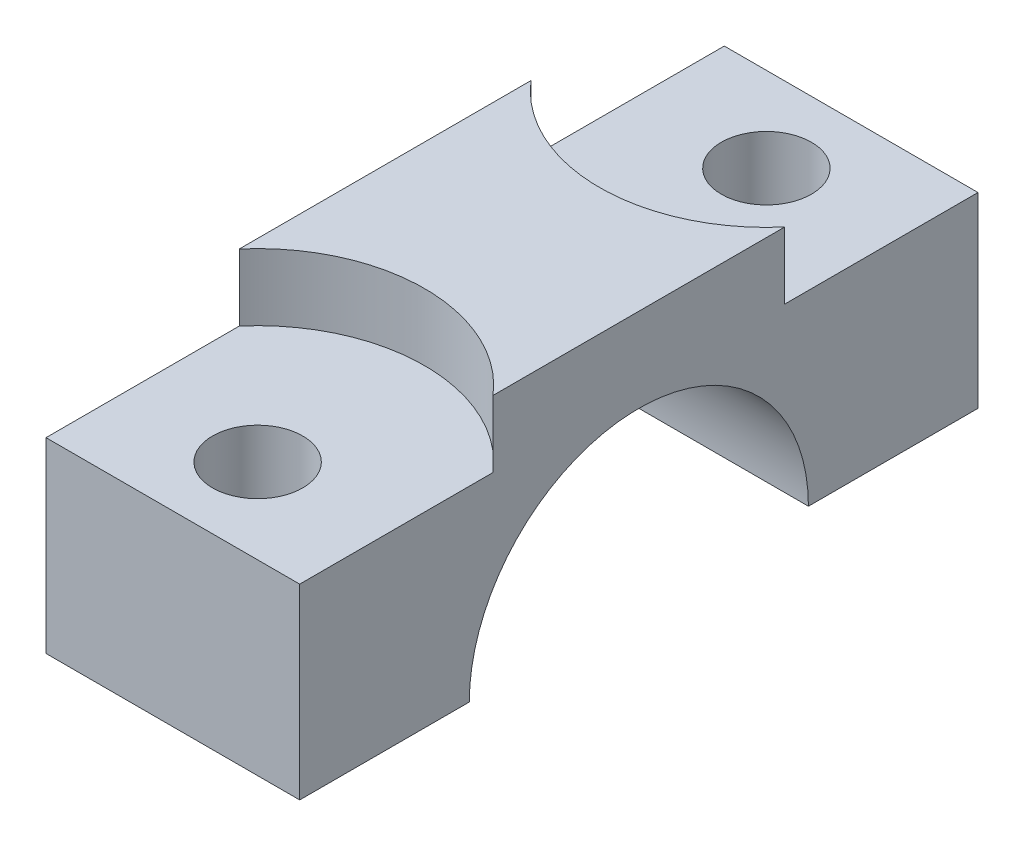
ISO-10303-21;
HEADER;
FILE_DESCRIPTION(('STEP AP214'),'2;1');
FILE_NAME('part.step','',(''),(''),'','','');
FILE_SCHEMA(('AUTOMOTIVE_DESIGN { 1 0 10303 214 1 1 1 1 }'));
ENDSEC;
DATA;
#1=APPLICATION_CONTEXT('core data for automotive mechanical design processes');
#2=APPLICATION_PROTOCOL_DEFINITION('international standard','automotive_design',2000,#1);
#3=PRODUCT_CONTEXT('',#1,'mechanical');
#4=PRODUCT('Part','Part','',(#3));
#5=PRODUCT_RELATED_PRODUCT_CATEGORY('part','',(#4));
#6=PRODUCT_DEFINITION_FORMATION('','',#4);
#7=PRODUCT_DEFINITION_CONTEXT('part definition',#1,'design');
#8=PRODUCT_DEFINITION('design','',#6,#7);
#9=PRODUCT_DEFINITION_SHAPE('','',#8);
#10=(LENGTH_UNIT() NAMED_UNIT(*) SI_UNIT(.MILLI.,.METRE.));
#11=(NAMED_UNIT(*) PLANE_ANGLE_UNIT() SI_UNIT($,.RADIAN.));
#12=(NAMED_UNIT(*) SI_UNIT($,.STERADIAN.) SOLID_ANGLE_UNIT());
#13=UNCERTAINTY_MEASURE_WITH_UNIT(LENGTH_MEASURE(1.E-05),#10,'distance_accuracy_value','');
#14=(GEOMETRIC_REPRESENTATION_CONTEXT(3) GLOBAL_UNCERTAINTY_ASSIGNED_CONTEXT((#13)) GLOBAL_UNIT_ASSIGNED_CONTEXT((#10,
#11,#12)) REPRESENTATION_CONTEXT('',''));
#15=CARTESIAN_POINT('',(0.,0.,0.));
#16=DIRECTION('',(0.,0.,1.));
#17=DIRECTION('',(1.,0.,0.));
#18=AXIS2_PLACEMENT_3D('',#15,#16,#17);
#19=CARTESIAN_POINT('',(9.5,19.,25.4));
#20=DIRECTION('',(0.,1.,0.));
#21=DIRECTION('',(0.,0.,1.));
#22=AXIS2_PLACEMENT_3D('',#19,#20,#21);
#23=PLANE('',#22);
#24=CARTESIAN_POINT('',(0.,19.,19.05));
#25=DIRECTION('',(0.,1.,0.));
#26=DIRECTION('',(0.,0.,1.));
#27=AXIS2_PLACEMENT_3D('',#24,#25,#26);
#28=CIRCLE('',#27,12.5);
#29=CARTESIAN_POINT('',(9.5,19.,10.925961595364));
#30=VERTEX_POINT('',#29);
#31=CARTESIAN_POINT('',(-9.5,19.,10.925961595364));
#32=VERTEX_POINT('',#31);
#33=EDGE_CURVE('E130',#30,#32,#28,.T.);
#34=ORIENTED_EDGE('',*,*,#33,.F.);
#35=DIRECTION('',(0.,0.,-1.));
#36=VECTOR('',#35,1.);
#37=CARTESIAN_POINT('',(9.5,19.,25.4));
#38=LINE('',#37,#36);
#39=CARTESIAN_POINT('',(9.5,19.,-10.925961595364));
#40=VERTEX_POINT('',#39);
#41=EDGE_CURVE('E62',#30,#40,#38,.T.);
#42=ORIENTED_EDGE('',*,*,#41,.T.);
#43=CARTESIAN_POINT('',(0.,19.,-19.05));
#44=DIRECTION('',(0.,1.,0.));
#45=DIRECTION('',(0.,0.,1.));
#46=AXIS2_PLACEMENT_3D('',#43,#44,#45);
#47=CIRCLE('',#46,12.5);
#48=CARTESIAN_POINT('',(-9.5,19.,-10.925961595364));
#49=VERTEX_POINT('',#48);
#50=EDGE_CURVE('E134',#49,#40,#47,.T.);
#51=ORIENTED_EDGE('',*,*,#50,.F.);
#52=DIRECTION('',(0.,0.,-1.));
#53=VECTOR('',#52,1.);
#54=CARTESIAN_POINT('',(-9.5,19.,25.4));
#55=LINE('',#54,#53);
#56=EDGE_CURVE('E153',#32,#49,#55,.T.);
#57=ORIENTED_EDGE('',*,*,#56,.F.);
#58=EDGE_LOOP('',(#34,#42,#51,#57));
#59=FACE_BOUND('',#58,.T.);
#60=ADVANCED_FACE('F41',(#59),#23,.T.);
#61=CARTESIAN_POINT('',(9.5,19.,25.4));
#62=DIRECTION('',(0.,0.,-1.));
#63=DIRECTION('',(0.,1.,0.));
#64=AXIS2_PLACEMENT_3D('',#61,#62,#63);
#65=PLANE('',#64);
#66=DIRECTION('',(0.,-1.,0.));
#67=VECTOR('',#66,1.);
#68=CARTESIAN_POINT('',(9.5,19.,25.4));
#69=LINE('',#68,#67);
#70=CARTESIAN_POINT('',(9.5,14.,25.4));
#71=VERTEX_POINT('',#70);
#72=CARTESIAN_POINT('',(9.5,0.,25.4));
#73=VERTEX_POINT('',#72);
#74=EDGE_CURVE('E165',#71,#73,#69,.T.);
#75=ORIENTED_EDGE('',*,*,#74,.F.);
#76=DIRECTION('',(-1.,0.,0.));
#77=VECTOR('',#76,1.);
#78=CARTESIAN_POINT('',(9.5,14.,25.4));
#79=LINE('',#78,#77);
#80=CARTESIAN_POINT('',(-9.5,14.,25.4));
#81=VERTEX_POINT('',#80);
#82=EDGE_CURVE('E119',#71,#81,#79,.T.);
#83=ORIENTED_EDGE('',*,*,#82,.T.);
#84=DIRECTION('',(0.,-1.,0.));
#85=VECTOR('',#84,1.);
#86=CARTESIAN_POINT('',(-9.5,19.,25.4));
#87=LINE('',#86,#85);
#88=CARTESIAN_POINT('',(-9.5,0.,25.4));
#89=VERTEX_POINT('',#88);
#90=EDGE_CURVE('E156',#81,#89,#87,.T.);
#91=ORIENTED_EDGE('',*,*,#90,.T.);
#92=DIRECTION('',(-1.,0.,0.));
#93=VECTOR('',#92,1.);
#94=CARTESIAN_POINT('',(9.5,0.,25.4));
#95=LINE('',#94,#93);
#96=EDGE_CURVE('E179',#73,#89,#95,.T.);
#97=ORIENTED_EDGE('',*,*,#96,.F.);
#98=EDGE_LOOP('',(#75,#83,#91,#97));
#99=FACE_BOUND('',#98,.T.);
#100=ADVANCED_FACE('F199',(#99),#65,.F.);
#101=CARTESIAN_POINT('',(9.5,0.,25.4));
#102=DIRECTION('',(0.,1.,0.));
#103=DIRECTION('',(0.,0.,1.));
#104=AXIS2_PLACEMENT_3D('',#101,#102,#103);
#105=PLANE('',#104);
#106=CARTESIAN_POINT('',(0.,0.,19.05));
#107=DIRECTION('',(0.,1.,0.));
#108=DIRECTION('',(0.,0.,1.));
#109=AXIS2_PLACEMENT_3D('',#106,#107,#108);
#110=CIRCLE('',#109,3.375);
#111=CARTESIAN_POINT('',(0.,0.,22.425));
#112=VERTEX_POINT('',#111);
#113=EDGE_CURVE('E201',#112,#112,#110,.T.);
#114=ORIENTED_EDGE('',*,*,#113,.T.);
#115=EDGE_LOOP('',(#114));
#116=FACE_BOUND('',#115,.T.);
#117=DIRECTION('',(0.,0.,-1.));
#118=VECTOR('',#117,1.);
#119=CARTESIAN_POINT('',(-9.5,0.,25.4));
#120=LINE('',#119,#118);
#121=CARTESIAN_POINT('',(-9.5,0.,12.7));
#122=VERTEX_POINT('',#121);
#123=EDGE_CURVE('E176',#89,#122,#120,.T.);
#124=ORIENTED_EDGE('',*,*,#123,.T.);
#125=DIRECTION('',(-1.,0.,0.));
#126=VECTOR('',#125,1.);
#127=CARTESIAN_POINT('',(9.5,0.,12.7));
#128=LINE('',#127,#126);
#129=CARTESIAN_POINT('',(9.5,0.,12.7));
#130=VERTEX_POINT('',#129);
#131=EDGE_CURVE('E183',#130,#122,#128,.T.);
#132=ORIENTED_EDGE('',*,*,#131,.F.);
#133=DIRECTION('',(0.,0.,-1.));
#134=VECTOR('',#133,1.);
#135=CARTESIAN_POINT('',(9.5,0.,25.4));
#136=LINE('',#135,#134);
#137=EDGE_CURVE('E163',#73,#130,#136,.T.);
#138=ORIENTED_EDGE('',*,*,#137,.F.);
#139=ORIENTED_EDGE('',*,*,#96,.T.);
#140=EDGE_LOOP('',(#124,#132,#138,#139));
#141=FACE_BOUND('',#140,.T.);
#142=ADVANCED_FACE('F208',(#116,#141),#105,.F.);
#143=CARTESIAN_POINT('',(9.5,0.,0.));
#144=DIRECTION('',(-1.,0.,0.));
#145=DIRECTION('',(0.,0.,1.));
#146=AXIS2_PLACEMENT_3D('',#143,#144,#145);
#147=CYLINDRICAL_SURFACE('',#146,12.7);
#148=CARTESIAN_POINT('',(-9.5,0.,0.));
#149=DIRECTION('',(-1.,0.,0.));
#150=DIRECTION('',(0.,0.,1.));
#151=AXIS2_PLACEMENT_3D('',#148,#149,#150);
#152=CIRCLE('',#151,12.7);
#153=CARTESIAN_POINT('',(-9.5,0.,-12.7));
#154=VERTEX_POINT('',#153);
#155=EDGE_CURVE('E174',#122,#154,#152,.T.);
#156=ORIENTED_EDGE('',*,*,#155,.T.);
#157=DIRECTION('',(-1.,0.,0.));
#158=VECTOR('',#157,1.);
#159=CARTESIAN_POINT('',(9.5,0.,-12.7));
#160=LINE('',#159,#158);
#161=CARTESIAN_POINT('',(9.5,0.,-12.7));
#162=VERTEX_POINT('',#161);
#163=EDGE_CURVE('E186',#162,#154,#160,.T.);
#164=ORIENTED_EDGE('',*,*,#163,.F.);
#165=CARTESIAN_POINT('',(9.5,0.,0.));
#166=DIRECTION('',(-1.,0.,0.));
#167=DIRECTION('',(0.,0.,1.));
#168=AXIS2_PLACEMENT_3D('',#165,#166,#167);
#169=CIRCLE('',#168,12.7);
#170=EDGE_CURVE('E161',#130,#162,#169,.T.);
#171=ORIENTED_EDGE('',*,*,#170,.F.);
#172=ORIENTED_EDGE('',*,*,#131,.T.);
#173=EDGE_LOOP('',(#156,#164,#171,#172));
#174=FACE_BOUND('',#173,.T.);
#175=ADVANCED_FACE('F212',(#174),#147,.F.);
#176=CARTESIAN_POINT('',(9.5,0.,-12.7));
#177=DIRECTION('',(0.,1.,0.));
#178=DIRECTION('',(0.,0.,1.));
#179=AXIS2_PLACEMENT_3D('',#176,#177,#178);
#180=PLANE('',#179);
#181=CARTESIAN_POINT('',(0.,0.,-19.05));
#182=DIRECTION('',(0.,1.,0.));
#183=DIRECTION('',(0.,0.,1.));
#184=AXIS2_PLACEMENT_3D('',#181,#182,#183);
#185=CIRCLE('',#184,3.375);
#186=CARTESIAN_POINT('',(0.,0.,-15.675));
#187=VERTEX_POINT('',#186);
#188=EDGE_CURVE('E145',#187,#187,#185,.T.);
#189=ORIENTED_EDGE('',*,*,#188,.T.);
#190=EDGE_LOOP('',(#189));
#191=FACE_BOUND('',#190,.T.);
#192=DIRECTION('',(0.,0.,-1.));
#193=VECTOR('',#192,1.);
#194=CARTESIAN_POINT('',(-9.5,0.,-12.7));
#195=LINE('',#194,#193);
#196=CARTESIAN_POINT('',(-9.5,0.,-25.4));
#197=VERTEX_POINT('',#196);
#198=EDGE_CURVE('E171',#154,#197,#195,.T.);
#199=ORIENTED_EDGE('',*,*,#198,.T.);
#200=DIRECTION('',(-1.,0.,0.));
#201=VECTOR('',#200,1.);
#202=CARTESIAN_POINT('',(9.5,0.,-25.4));
#203=LINE('',#202,#201);
#204=CARTESIAN_POINT('',(9.5,0.,-25.4));
#205=VERTEX_POINT('',#204);
#206=EDGE_CURVE('E167',#205,#197,#203,.T.);
#207=ORIENTED_EDGE('',*,*,#206,.F.);
#208=DIRECTION('',(0.,0.,-1.));
#209=VECTOR('',#208,1.);
#210=CARTESIAN_POINT('',(9.5,0.,-12.7));
#211=LINE('',#210,#209);
#212=EDGE_CURVE('E158',#162,#205,#211,.T.);
#213=ORIENTED_EDGE('',*,*,#212,.F.);
#214=ORIENTED_EDGE('',*,*,#163,.T.);
#215=EDGE_LOOP('',(#199,#207,#213,#214));
#216=FACE_BOUND('',#215,.T.);
#217=ADVANCED_FACE('F218',(#191,#216),#180,.F.);
#218=CARTESIAN_POINT('',(9.5,19.,-25.4));
#219=DIRECTION('',(0.,0.,-1.));
#220=DIRECTION('',(0.,1.,0.));
#221=AXIS2_PLACEMENT_3D('',#218,#219,#220);
#222=PLANE('',#221);
#223=DIRECTION('',(-1.,0.,0.));
#224=VECTOR('',#223,1.);
#225=CARTESIAN_POINT('',(9.5,14.,-25.4));
#226=LINE('',#225,#224);
#227=CARTESIAN_POINT('',(9.5,14.,-25.4));
#228=VERTEX_POINT('',#227);
#229=CARTESIAN_POINT('',(-9.5,14.,-25.4));
#230=VERTEX_POINT('',#229);
#231=EDGE_CURVE('E151',#228,#230,#226,.T.);
#232=ORIENTED_EDGE('',*,*,#231,.F.);
#233=DIRECTION('',(0.,-1.,0.));
#234=VECTOR('',#233,1.);
#235=CARTESIAN_POINT('',(9.5,19.,-25.4));
#236=LINE('',#235,#234);
#237=EDGE_CURVE('E155',#228,#205,#236,.T.);
#238=ORIENTED_EDGE('',*,*,#237,.T.);
#239=ORIENTED_EDGE('',*,*,#206,.T.);
#240=DIRECTION('',(0.,-1.,0.));
#241=VECTOR('',#240,1.);
#242=CARTESIAN_POINT('',(-9.5,19.,-25.4));
#243=LINE('',#242,#241);
#244=EDGE_CURVE('E169',#230,#197,#243,.T.);
#245=ORIENTED_EDGE('',*,*,#244,.F.);
#246=EDGE_LOOP('',(#232,#238,#239,#245));
#247=FACE_BOUND('',#246,.T.);
#248=ADVANCED_FACE('F222',(#247),#222,.T.);
#249=CARTESIAN_POINT('',(9.5,0.,0.));
#250=DIRECTION('',(-1.,0.,0.));
#251=DIRECTION('',(0.,0.,1.));
#252=AXIS2_PLACEMENT_3D('',#249,#250,#251);
#253=PLANE('',#252);
#254=DIRECTION('',(0.,1.,0.));
#255=VECTOR('',#254,1.);
#256=CARTESIAN_POINT('',(9.5,19.,10.925961595364));
#257=LINE('',#256,#255);
#258=CARTESIAN_POINT('',(9.5,14.,10.925961595364));
#259=VERTEX_POINT('',#258);
#260=EDGE_CURVE('E123',#30,#259,#257,.F.);
#261=ORIENTED_EDGE('',*,*,#260,.T.);
#262=DIRECTION('',(0.,0.,1.));
#263=VECTOR('',#262,1.);
#264=CARTESIAN_POINT('',(9.5,14.,0.));
#265=LINE('',#264,#263);
#266=EDGE_CURVE('E116',#259,#71,#265,.T.);
#267=ORIENTED_EDGE('',*,*,#266,.T.);
#268=ORIENTED_EDGE('',*,*,#74,.T.);
#269=ORIENTED_EDGE('',*,*,#137,.T.);
#270=ORIENTED_EDGE('',*,*,#170,.T.);
#271=ORIENTED_EDGE('',*,*,#212,.T.);
#272=ORIENTED_EDGE('',*,*,#237,.F.);
#273=DIRECTION('',(0.,0.,1.));
#274=VECTOR('',#273,1.);
#275=CARTESIAN_POINT('',(9.5,14.,0.));
#276=LINE('',#275,#274);
#277=CARTESIAN_POINT('',(9.5,14.,-10.925961595364));
#278=VERTEX_POINT('',#277);
#279=EDGE_CURVE('E192',#228,#278,#276,.T.);
#280=ORIENTED_EDGE('',*,*,#279,.T.);
#281=DIRECTION('',(0.,1.,0.));
#282=VECTOR('',#281,1.);
#283=CARTESIAN_POINT('',(9.5,19.,-10.925961595364));
#284=LINE('',#283,#282);
#285=EDGE_CURVE('E182',#278,#40,#284,.T.);
#286=ORIENTED_EDGE('',*,*,#285,.T.);
#287=ORIENTED_EDGE('',*,*,#41,.F.);
#288=EDGE_LOOP('',(#261,#267,#268,#269,#270,#271,#272,#280,#286,#287));
#289=FACE_BOUND('',#288,.T.);
#290=ADVANCED_FACE('F132',(#289),#253,.F.);
#291=CARTESIAN_POINT('',(-9.5,0.,0.));
#292=DIRECTION('',(-1.,0.,0.));
#293=DIRECTION('',(0.,0.,1.));
#294=AXIS2_PLACEMENT_3D('',#291,#292,#293);
#295=PLANE('',#294);
#296=DIRECTION('',(0.,1.,0.));
#297=VECTOR('',#296,1.);
#298=CARTESIAN_POINT('',(-9.5,19.,10.925961595364));
#299=LINE('',#298,#297);
#300=CARTESIAN_POINT('',(-9.5,14.,10.925961595364));
#301=VERTEX_POINT('',#300);
#302=EDGE_CURVE('E11',#32,#301,#299,.F.);
#303=ORIENTED_EDGE('',*,*,#302,.F.);
#304=ORIENTED_EDGE('',*,*,#56,.T.);
#305=DIRECTION('',(0.,1.,0.));
#306=VECTOR('',#305,1.);
#307=CARTESIAN_POINT('',(-9.5,19.,-10.925961595364));
#308=LINE('',#307,#306);
#309=CARTESIAN_POINT('',(-9.5,14.,-10.925961595364));
#310=VERTEX_POINT('',#309);
#311=EDGE_CURVE('E148',#310,#49,#308,.T.);
#312=ORIENTED_EDGE('',*,*,#311,.F.);
#313=DIRECTION('',(0.,0.,1.));
#314=VECTOR('',#313,1.);
#315=CARTESIAN_POINT('',(-9.5,14.,0.));
#316=LINE('',#315,#314);
#317=EDGE_CURVE('E195',#230,#310,#316,.T.);
#318=ORIENTED_EDGE('',*,*,#317,.F.);
#319=ORIENTED_EDGE('',*,*,#244,.T.);
#320=ORIENTED_EDGE('',*,*,#198,.F.);
#321=ORIENTED_EDGE('',*,*,#155,.F.);
#322=ORIENTED_EDGE('',*,*,#123,.F.);
#323=ORIENTED_EDGE('',*,*,#90,.F.);
#324=DIRECTION('',(0.,0.,1.));
#325=VECTOR('',#324,1.);
#326=CARTESIAN_POINT('',(-9.5,14.,0.));
#327=LINE('',#326,#325);
#328=EDGE_CURVE('E48',#301,#81,#327,.T.);
#329=ORIENTED_EDGE('',*,*,#328,.F.);
#330=EDGE_LOOP('',(#303,#304,#312,#318,#319,#320,#321,#322,#323,#329));
#331=FACE_BOUND('',#330,.T.);
#332=ADVANCED_FACE('F203',(#331),#295,.T.);
#333=CARTESIAN_POINT('',(3.375,14.,-19.05));
#334=DIRECTION('',(0.,-1.,0.));
#335=DIRECTION('',(0.,0.,-1.));
#336=AXIS2_PLACEMENT_3D('',#333,#334,#335);
#337=PLANE('',#336);
#338=CARTESIAN_POINT('',(0.,14.,-19.05));
#339=DIRECTION('',(0.,1.,0.));
#340=DIRECTION('',(0.,0.,1.));
#341=AXIS2_PLACEMENT_3D('',#338,#339,#340);
#342=CIRCLE('',#341,3.375);
#343=CARTESIAN_POINT('',(0.,14.,-15.675));
#344=VERTEX_POINT('',#343);
#345=EDGE_CURVE('E142',#344,#344,#342,.T.);
#346=ORIENTED_EDGE('',*,*,#345,.F.);
#347=EDGE_LOOP('',(#346));
#348=FACE_BOUND('',#347,.T.);
#349=ORIENTED_EDGE('',*,*,#231,.T.);
#350=ORIENTED_EDGE('',*,*,#317,.T.);
#351=CARTESIAN_POINT('',(0.,14.,-19.05));
#352=DIRECTION('',(0.,1.,0.));
#353=DIRECTION('',(0.,0.,1.));
#354=AXIS2_PLACEMENT_3D('',#351,#352,#353);
#355=CIRCLE('',#354,12.5);
#356=EDGE_CURVE('E136',#310,#278,#355,.T.);
#357=ORIENTED_EDGE('',*,*,#356,.T.);
#358=ORIENTED_EDGE('',*,*,#279,.F.);
#359=EDGE_LOOP('',(#349,#350,#357,#358));
#360=FACE_BOUND('',#359,.T.);
#361=ADVANCED_FACE('F225',(#348,#360),#337,.F.);
#362=CARTESIAN_POINT('',(0.,19.,-19.05));
#363=DIRECTION('',(0.,1.,0.));
#364=DIRECTION('',(0.,0.,1.));
#365=AXIS2_PLACEMENT_3D('',#362,#363,#364);
#366=CYLINDRICAL_SURFACE('',#365,3.375);
#367=ORIENTED_EDGE('',*,*,#188,.F.);
#368=EDGE_LOOP('',(#367));
#369=FACE_BOUND('',#368,.T.);
#370=ORIENTED_EDGE('',*,*,#345,.T.);
#371=EDGE_LOOP('',(#370));
#372=FACE_BOUND('',#371,.T.);
#373=ADVANCED_FACE('F275',(#369,#372),#366,.F.);
#374=CARTESIAN_POINT('',(0.,19.,-19.05));
#375=DIRECTION('',(0.,1.,0.));
#376=DIRECTION('',(0.,0.,1.));
#377=AXIS2_PLACEMENT_3D('',#374,#375,#376);
#378=CYLINDRICAL_SURFACE('',#377,12.5);
#379=ORIENTED_EDGE('',*,*,#311,.T.);
#380=ORIENTED_EDGE('',*,*,#50,.T.);
#381=ORIENTED_EDGE('',*,*,#285,.F.);
#382=ORIENTED_EDGE('',*,*,#356,.F.);
#383=EDGE_LOOP('',(#379,#380,#381,#382));
#384=FACE_BOUND('',#383,.T.);
#385=ADVANCED_FACE('F230',(#384),#378,.F.);
#386=CARTESIAN_POINT('',(0.,19.,19.05));
#387=DIRECTION('',(0.,1.,0.));
#388=DIRECTION('',(0.,0.,1.));
#389=AXIS2_PLACEMENT_3D('',#386,#387,#388);
#390=CYLINDRICAL_SURFACE('',#389,12.5);
#391=ORIENTED_EDGE('',*,*,#33,.T.);
#392=ORIENTED_EDGE('',*,*,#302,.T.);
#393=CARTESIAN_POINT('',(0.,14.,19.05));
#394=DIRECTION('',(0.,1.,0.));
#395=DIRECTION('',(0.,0.,1.));
#396=AXIS2_PLACEMENT_3D('',#393,#394,#395);
#397=CIRCLE('',#396,12.5);
#398=EDGE_CURVE('E55',#259,#301,#397,.T.);
#399=ORIENTED_EDGE('',*,*,#398,.F.);
#400=ORIENTED_EDGE('',*,*,#260,.F.);
#401=EDGE_LOOP('',(#391,#392,#399,#400));
#402=FACE_BOUND('',#401,.T.);
#403=ADVANCED_FACE('F126',(#402),#390,.F.);
#404=CARTESIAN_POINT('',(3.375,14.,19.05));
#405=DIRECTION('',(0.,-1.,0.));
#406=DIRECTION('',(0.,0.,-1.));
#407=AXIS2_PLACEMENT_3D('',#404,#405,#406);
#408=PLANE('',#407);
#409=CARTESIAN_POINT('',(0.,14.,19.05));
#410=DIRECTION('',(0.,1.,0.));
#411=DIRECTION('',(0.,0.,1.));
#412=AXIS2_PLACEMENT_3D('',#409,#410,#411);
#413=CIRCLE('',#412,3.375);
#414=CARTESIAN_POINT('',(0.,14.,22.425));
#415=VERTEX_POINT('',#414);
#416=EDGE_CURVE('E129',#415,#415,#413,.T.);
#417=ORIENTED_EDGE('',*,*,#416,.F.);
#418=EDGE_LOOP('',(#417));
#419=FACE_BOUND('',#418,.T.);
#420=ORIENTED_EDGE('',*,*,#398,.T.);
#421=ORIENTED_EDGE('',*,*,#328,.T.);
#422=ORIENTED_EDGE('',*,*,#82,.F.);
#423=ORIENTED_EDGE('',*,*,#266,.F.);
#424=EDGE_LOOP('',(#420,#421,#422,#423));
#425=FACE_BOUND('',#424,.T.);
#426=ADVANCED_FACE('F117',(#419,#425),#408,.F.);
#427=CARTESIAN_POINT('',(0.,19.,19.05));
#428=DIRECTION('',(0.,1.,0.));
#429=DIRECTION('',(0.,0.,1.));
#430=AXIS2_PLACEMENT_3D('',#427,#428,#429);
#431=CYLINDRICAL_SURFACE('',#430,3.375);
#432=ORIENTED_EDGE('',*,*,#113,.F.);
#433=EDGE_LOOP('',(#432));
#434=FACE_BOUND('',#433,.T.);
#435=ORIENTED_EDGE('',*,*,#416,.T.);
#436=EDGE_LOOP('',(#435));
#437=FACE_BOUND('',#436,.T.);
#438=ADVANCED_FACE('F239',(#434,#437),#431,.F.);
#439=CLOSED_SHELL('',(#60,#100,#142,#175,#217,#248,#290,#332,#361,#373,#385,#403,#426,#438));
#440=MANIFOLD_SOLID_BREP('B2',#439);
#441=ADVANCED_BREP_SHAPE_REPRESENTATION('',(#18,#440),#14);
#442=SHAPE_DEFINITION_REPRESENTATION(#9,#441);
ENDSEC;
END-ISO-10303-21;
